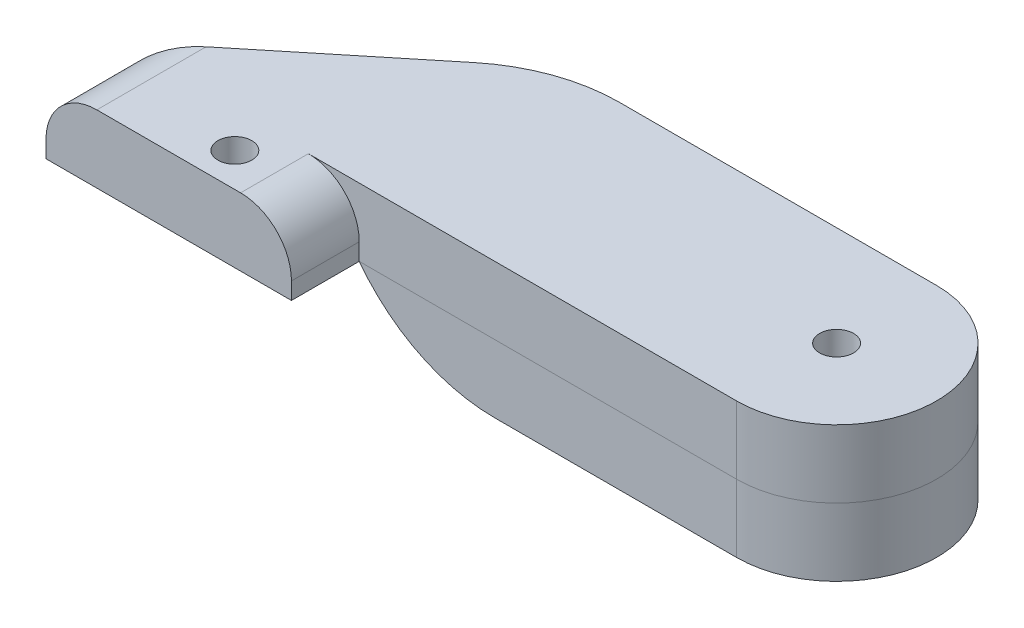
ISO-10303-21;
HEADER;
FILE_DESCRIPTION(('STEP AP214'),'2;1');
FILE_NAME('part.step','',(''),(''),'','','');
FILE_SCHEMA(('AUTOMOTIVE_DESIGN { 1 0 10303 214 1 1 1 1 }'));
ENDSEC;
DATA;
#1=APPLICATION_CONTEXT('core data for automotive mechanical design processes');
#2=APPLICATION_PROTOCOL_DEFINITION('international standard','automotive_design',2000,#1);
#3=PRODUCT_CONTEXT('',#1,'mechanical');
#4=PRODUCT('Part','Part','',(#3));
#5=PRODUCT_RELATED_PRODUCT_CATEGORY('part','',(#4));
#6=PRODUCT_DEFINITION_FORMATION('','',#4);
#7=PRODUCT_DEFINITION_CONTEXT('part definition',#1,'design');
#8=PRODUCT_DEFINITION('design','',#6,#7);
#9=PRODUCT_DEFINITION_SHAPE('','',#8);
#10=(LENGTH_UNIT() NAMED_UNIT(*) SI_UNIT(.MILLI.,.METRE.));
#11=(NAMED_UNIT(*) PLANE_ANGLE_UNIT() SI_UNIT($,.RADIAN.));
#12=(NAMED_UNIT(*) SI_UNIT($,.STERADIAN.) SOLID_ANGLE_UNIT());
#13=UNCERTAINTY_MEASURE_WITH_UNIT(LENGTH_MEASURE(1.E-05),#10,'distance_accuracy_value','');
#14=(GEOMETRIC_REPRESENTATION_CONTEXT(3) GLOBAL_UNCERTAINTY_ASSIGNED_CONTEXT((#13)) GLOBAL_UNIT_ASSIGNED_CONTEXT((#10,
#11,#12)) REPRESENTATION_CONTEXT('',''));
#15=CARTESIAN_POINT('',(0.,0.,0.));
#16=DIRECTION('',(0.,0.,1.));
#17=DIRECTION('',(1.,0.,0.));
#18=AXIS2_PLACEMENT_3D('',#15,#16,#17);
#19=CARTESIAN_POINT('',(19.8378099908885,4.,-1.99947612195635));
#20=DIRECTION('',(0.,0.,-1.));
#21=DIRECTION('',(-1.,0.,0.));
#22=AXIS2_PLACEMENT_3D('',#19,#20,#21);
#23=PLANE('',#22);
#24=DIRECTION('',(1.,0.,0.));
#25=VECTOR('',#24,1.);
#26=CARTESIAN_POINT('',(19.8378099908885,0.,-1.99947612195635));
#27=LINE('',#26,#25);
#28=CARTESIAN_POINT('',(19.8378099908885,0.,-1.99947612195635));
#29=VERTEX_POINT('',#28);
#30=CARTESIAN_POINT('',(42.1,0.,-1.99947612195635));
#31=VERTEX_POINT('',#30);
#32=EDGE_CURVE('E229',#29,#31,#27,.T.);
#33=ORIENTED_EDGE('',*,*,#32,.T.);
#34=DIRECTION('',(0.,-1.,0.));
#35=VECTOR('',#34,1.);
#36=CARTESIAN_POINT('',(42.1,4.,-1.99947612195635));
#37=LINE('',#36,#35);
#38=CARTESIAN_POINT('',(42.1,4.,-1.99947612195635));
#39=VERTEX_POINT('',#38);
#40=EDGE_CURVE('E272',#39,#31,#37,.T.);
#41=ORIENTED_EDGE('',*,*,#40,.F.);
#42=DIRECTION('',(1.,0.,0.));
#43=VECTOR('',#42,1.);
#44=CARTESIAN_POINT('',(19.8378099908885,4.,-1.99947612195635));
#45=LINE('',#44,#43);
#46=CARTESIAN_POINT('',(16.8378099908885,4.,-1.99947612195635));
#47=VERTEX_POINT('',#46);
#48=EDGE_CURVE('E230',#47,#39,#45,.T.);
#49=ORIENTED_EDGE('',*,*,#48,.F.);
#50=CARTESIAN_POINT('',(16.8378099908885,1.,-1.99947612195635));
#51=DIRECTION('',(0.,0.,-1.));
#52=DIRECTION('',(-1.,0.,0.));
#53=AXIS2_PLACEMENT_3D('',#50,#51,#52);
#54=CIRCLE('',#53,3.);
#55=CARTESIAN_POINT('',(19.8378099908885,1.,-1.99947612195635));
#56=VERTEX_POINT('',#55);
#57=EDGE_CURVE('E11',#47,#56,#54,.T.);
#58=ORIENTED_EDGE('',*,*,#57,.T.);
#59=DIRECTION('',(0.,-1.,0.));
#60=VECTOR('',#59,1.);
#61=CARTESIAN_POINT('',(19.8378099908885,4.,-1.99947612195635));
#62=LINE('',#61,#60);
#63=EDGE_CURVE('E245',#56,#29,#62,.T.);
#64=ORIENTED_EDGE('',*,*,#63,.T.);
#65=EDGE_LOOP('',(#33,#41,#49,#58,#64));
#66=FACE_BOUND('',#65,.T.);
#67=ADVANCED_FACE('F32',(#66),#23,.F.);
#68=CARTESIAN_POINT('',(42.1,4.,-7.89973806097817));
#69=DIRECTION('',(0.,-1.,0.));
#70=DIRECTION('',(0.,0.,-1.));
#71=AXIS2_PLACEMENT_3D('',#68,#69,#70);
#72=CYLINDRICAL_SURFACE('',#71,5.90026193902183);
#73=CARTESIAN_POINT('',(42.1,0.,-7.89973806097817));
#74=DIRECTION('',(0.,1.,0.));
#75=DIRECTION('',(0.,0.,-1.));
#76=AXIS2_PLACEMENT_3D('',#73,#74,#75);
#77=CIRCLE('',#76,5.90026193902183);
#78=CARTESIAN_POINT('',(42.1,0.,-13.8));
#79=VERTEX_POINT('',#78);
#80=EDGE_CURVE('E248',#31,#79,#77,.T.);
#81=ORIENTED_EDGE('',*,*,#80,.T.);
#82=DIRECTION('',(0.,-1.,0.));
#83=VECTOR('',#82,1.);
#84=CARTESIAN_POINT('',(42.1,4.,-13.8));
#85=LINE('',#84,#83);
#86=CARTESIAN_POINT('',(42.1,4.,-13.8));
#87=VERTEX_POINT('',#86);
#88=EDGE_CURVE('E269',#87,#79,#85,.T.);
#89=ORIENTED_EDGE('',*,*,#88,.F.);
#90=CARTESIAN_POINT('',(42.1,4.,-7.89973806097817));
#91=DIRECTION('',(0.,1.,0.));
#92=DIRECTION('',(0.,0.,-1.));
#93=AXIS2_PLACEMENT_3D('',#90,#91,#92);
#94=CIRCLE('',#93,5.90026193902183);
#95=EDGE_CURVE('E233',#39,#87,#94,.T.);
#96=ORIENTED_EDGE('',*,*,#95,.F.);
#97=ORIENTED_EDGE('',*,*,#40,.T.);
#98=EDGE_LOOP('',(#81,#89,#96,#97));
#99=FACE_BOUND('',#98,.T.);
#100=ADVANCED_FACE('F347',(#99),#72,.T.);
#101=CARTESIAN_POINT('',(19.8378099908885,4.,-13.8));
#102=DIRECTION('',(0.,0.,1.));
#103=DIRECTION('',(1.,0.,0.));
#104=AXIS2_PLACEMENT_3D('',#101,#102,#103);
#105=PLANE('',#104);
#106=CARTESIAN_POINT('',(27.8378099908885,6.,-13.8));
#107=DIRECTION('',(0.,0.,1.));
#108=DIRECTION('',(1.,0.,0.));
#109=AXIS2_PLACEMENT_3D('',#106,#107,#108);
#110=CIRCLE('',#109,10.);
#111=CARTESIAN_POINT('',(27.8378099908885,-4.,-13.8));
#112=VERTEX_POINT('',#111);
#113=CARTESIAN_POINT('',(23.3965286051537,-2.95963278559594,-13.8));
#114=VERTEX_POINT('',#113);
#115=EDGE_CURVE('E291',#112,#114,#110,.F.);
#116=ORIENTED_EDGE('',*,*,#115,.T.);
#117=DIRECTION('',(0.,-1.,0.));
#118=VECTOR('',#117,1.);
#119=CARTESIAN_POINT('',(23.3965286051537,4.,-13.8));
#120=LINE('',#119,#118);
#121=CARTESIAN_POINT('',(23.3965286051537,4.,-13.8));
#122=VERTEX_POINT('',#121);
#123=EDGE_CURVE('E384',#114,#122,#120,.F.);
#124=ORIENTED_EDGE('',*,*,#123,.T.);
#125=DIRECTION('',(-1.,0.,0.));
#126=VECTOR('',#125,1.);
#127=CARTESIAN_POINT('',(19.8378099908885,4.,-13.8));
#128=LINE('',#127,#126);
#129=EDGE_CURVE('E236',#87,#122,#128,.T.);
#130=ORIENTED_EDGE('',*,*,#129,.F.);
#131=ORIENTED_EDGE('',*,*,#88,.T.);
#132=DIRECTION('',(0.,1.,0.));
#133=VECTOR('',#132,1.);
#134=CARTESIAN_POINT('',(42.1,-4.,-13.8));
#135=LINE('',#134,#133);
#136=CARTESIAN_POINT('',(42.1,-4.,-13.8));
#137=VERTEX_POINT('',#136);
#138=EDGE_CURVE('E226',#137,#79,#135,.T.);
#139=ORIENTED_EDGE('',*,*,#138,.F.);
#140=DIRECTION('',(1.,0.,0.));
#141=VECTOR('',#140,1.);
#142=CARTESIAN_POINT('',(19.8378099908885,-4.,-13.8));
#143=LINE('',#142,#141);
#144=EDGE_CURVE('E208',#112,#137,#143,.T.);
#145=ORIENTED_EDGE('',*,*,#144,.F.);
#146=EDGE_LOOP('',(#116,#124,#130,#131,#139,#145));
#147=FACE_BOUND('',#146,.T.);
#148=ADVANCED_FACE('F343',(#147),#105,.F.);
#149=CARTESIAN_POINT('',(5.35780999088846,4.,-1.99947612195635));
#150=DIRECTION('',(0.631737468968907,0.,0.775182410985156));
#151=DIRECTION('',(0.775182410985156,0.,-0.631737468968907));
#152=AXIS2_PLACEMENT_3D('',#149,#150,#151);
#153=PLANE('',#152);
#154=DIRECTION('',(0.,-1.,0.));
#155=VECTOR('',#154,1.);
#156=CARTESIAN_POINT('',(5.35780999088846,4.,-1.99947612195635));
#157=LINE('',#156,#155);
#158=CARTESIAN_POINT('',(5.35780999088846,1.,-1.99947612195635));
#159=VERTEX_POINT('',#158);
#160=CARTESIAN_POINT('',(5.35780999088846,0.,-1.99947612195635));
#161=VERTEX_POINT('',#160);
#162=EDGE_CURVE('E267',#159,#161,#157,.T.);
#163=ORIENTED_EDGE('',*,*,#162,.F.);
#164=CARTESIAN_POINT('',(8.35780999088846,1.,-4.44433604144053));
#165=DIRECTION('',(0.631737468968907,0.,0.775182410985156));
#166=DIRECTION('',(-0.775182410985156,0.,0.631737468968907));
#167=AXIS2_PLACEMENT_3D('',#164,#165,#166);
#168=ELLIPSE('',#167,3.87005685047393,3.);
#169=CARTESIAN_POINT('',(8.35780999088846,4.,-4.44433604144053));
#170=VERTEX_POINT('',#169);
#171=EDGE_CURVE('E371',#159,#170,#168,.F.);
#172=ORIENTED_EDGE('',*,*,#171,.T.);
#173=DIRECTION('',(-0.775182410985156,0.,0.631737468968907));
#174=VECTOR('',#173,1.);
#175=CARTESIAN_POINT('',(5.35780999088846,4.,-1.99947612195635));
#176=LINE('',#175,#174);
#177=CARTESIAN_POINT('',(17.0791539154646,4.,-11.5518241098516));
#178=VERTEX_POINT('',#177);
#179=EDGE_CURVE('E239',#178,#170,#176,.T.);
#180=ORIENTED_EDGE('',*,*,#179,.F.);
#181=DIRECTION('',(0.,-1.,0.));
#182=VECTOR('',#181,1.);
#183=CARTESIAN_POINT('',(17.0791539154646,4.,-11.5518241098516));
#184=LINE('',#183,#182);
#185=CARTESIAN_POINT('',(17.0791539154646,0.,-11.5518241098516));
#186=VERTEX_POINT('',#185);
#187=EDGE_CURVE('E412',#178,#186,#184,.T.);
#188=ORIENTED_EDGE('',*,*,#187,.T.);
#189=DIRECTION('',(-0.775182410985156,0.,0.631737468968907));
#190=VECTOR('',#189,1.);
#191=CARTESIAN_POINT('',(5.35780999088846,0.,-1.99947612195635));
#192=LINE('',#191,#190);
#193=EDGE_CURVE('E251',#186,#161,#192,.T.);
#194=ORIENTED_EDGE('',*,*,#193,.T.);
#195=EDGE_LOOP('',(#163,#172,#180,#188,#194));
#196=FACE_BOUND('',#195,.T.);
#197=ADVANCED_FACE('F340',(#196),#153,.F.);
#198=CARTESIAN_POINT('',(5.35780999088846,4.,1.99947612195635));
#199=DIRECTION('',(1.,0.,0.));
#200=DIRECTION('',(0.,0.,-1.));
#201=AXIS2_PLACEMENT_3D('',#198,#199,#200);
#202=PLANE('',#201);
#203=DIRECTION('',(0.,-1.,0.));
#204=VECTOR('',#203,1.);
#205=CARTESIAN_POINT('',(5.35780999088846,4.,1.99947612195635));
#206=LINE('',#205,#204);
#207=CARTESIAN_POINT('',(5.35780999088846,1.,1.99947612195635));
#208=VERTEX_POINT('',#207);
#209=CARTESIAN_POINT('',(5.35780999088846,0.,1.99947612195635));
#210=VERTEX_POINT('',#209);
#211=EDGE_CURVE('E265',#208,#210,#206,.T.);
#212=ORIENTED_EDGE('',*,*,#211,.F.);
#213=DIRECTION('',(0.,0.,1.));
#214=VECTOR('',#213,1.);
#215=CARTESIAN_POINT('',(5.35780999088846,1.,1.99947612195635));
#216=LINE('',#215,#214);
#217=EDGE_CURVE('E53',#208,#159,#216,.F.);
#218=ORIENTED_EDGE('',*,*,#217,.T.);
#219=ORIENTED_EDGE('',*,*,#162,.T.);
#220=DIRECTION('',(0.,0.,1.));
#221=VECTOR('',#220,1.);
#222=CARTESIAN_POINT('',(5.35780999088846,0.,1.99947612195635));
#223=LINE('',#222,#221);
#224=EDGE_CURVE('E254',#161,#210,#223,.T.);
#225=ORIENTED_EDGE('',*,*,#224,.T.);
#226=EDGE_LOOP('',(#212,#218,#219,#225));
#227=FACE_BOUND('',#226,.T.);
#228=ADVANCED_FACE('F336',(#227),#202,.F.);
#229=CARTESIAN_POINT('',(5.35780999088846,4.,1.99947612195635));
#230=DIRECTION('',(0.,0.,-1.));
#231=DIRECTION('',(-1.,0.,0.));
#232=AXIS2_PLACEMENT_3D('',#229,#230,#231);
#233=PLANE('',#232);
#234=DIRECTION('',(1.,0.,0.));
#235=VECTOR('',#234,1.);
#236=CARTESIAN_POINT('',(5.35780999088846,4.,1.99947612195635));
#237=LINE('',#236,#235);
#238=CARTESIAN_POINT('',(8.35780999088846,4.,1.99947612195635));
#239=VERTEX_POINT('',#238);
#240=CARTESIAN_POINT('',(16.8378099908885,4.,1.99947612195635));
#241=VERTEX_POINT('',#240);
#242=EDGE_CURVE('E242',#239,#241,#237,.T.);
#243=ORIENTED_EDGE('',*,*,#242,.F.);
#244=CARTESIAN_POINT('',(8.35780999088846,1.,1.99947612195635));
#245=DIRECTION('',(0.,0.,-1.));
#246=DIRECTION('',(-1.,0.,0.));
#247=AXIS2_PLACEMENT_3D('',#244,#245,#246);
#248=CIRCLE('',#247,3.);
#249=EDGE_CURVE('E375',#239,#208,#248,.F.);
#250=ORIENTED_EDGE('',*,*,#249,.T.);
#251=ORIENTED_EDGE('',*,*,#211,.T.);
#252=DIRECTION('',(1.,0.,0.));
#253=VECTOR('',#252,1.);
#254=CARTESIAN_POINT('',(5.35780999088846,0.,1.99947612195635));
#255=LINE('',#254,#253);
#256=CARTESIAN_POINT('',(19.8378099908885,0.,1.99947612195635));
#257=VERTEX_POINT('',#256);
#258=EDGE_CURVE('E257',#210,#257,#255,.T.);
#259=ORIENTED_EDGE('',*,*,#258,.T.);
#260=DIRECTION('',(0.,-1.,0.));
#261=VECTOR('',#260,1.);
#262=CARTESIAN_POINT('',(19.8378099908885,4.,1.99947612195635));
#263=LINE('',#262,#261);
#264=CARTESIAN_POINT('',(19.8378099908885,1.,1.99947612195635));
#265=VERTEX_POINT('',#264);
#266=EDGE_CURVE('E263',#265,#257,#263,.T.);
#267=ORIENTED_EDGE('',*,*,#266,.F.);
#268=CARTESIAN_POINT('',(16.8378099908885,1.,1.99947612195635));
#269=DIRECTION('',(0.,0.,-1.));
#270=DIRECTION('',(-1.,0.,0.));
#271=AXIS2_PLACEMENT_3D('',#268,#269,#270);
#272=CIRCLE('',#271,3.);
#273=EDGE_CURVE('E369',#265,#241,#272,.F.);
#274=ORIENTED_EDGE('',*,*,#273,.T.);
#275=EDGE_LOOP('',(#243,#250,#251,#259,#267,#274));
#276=FACE_BOUND('',#275,.T.);
#277=ADVANCED_FACE('F332',(#276),#233,.F.);
#278=CARTESIAN_POINT('',(19.8378099908885,4.,1.99947612195635));
#279=DIRECTION('',(-1.,0.,0.));
#280=DIRECTION('',(0.,0.,1.));
#281=AXIS2_PLACEMENT_3D('',#278,#279,#280);
#282=PLANE('',#281);
#283=ORIENTED_EDGE('',*,*,#63,.F.);
#284=DIRECTION('',(0.,0.,-1.));
#285=VECTOR('',#284,1.);
#286=CARTESIAN_POINT('',(19.8378099908885,1.,1.99947612195635));
#287=LINE('',#286,#285);
#288=EDGE_CURVE('E40',#56,#265,#287,.F.);
#289=ORIENTED_EDGE('',*,*,#288,.T.);
#290=ORIENTED_EDGE('',*,*,#266,.T.);
#291=DIRECTION('',(0.,0.,-1.));
#292=VECTOR('',#291,1.);
#293=CARTESIAN_POINT('',(19.8378099908885,0.,1.99947612195635));
#294=LINE('',#293,#292);
#295=EDGE_CURVE('E234',#257,#29,#294,.T.);
#296=ORIENTED_EDGE('',*,*,#295,.T.);
#297=EDGE_LOOP('',(#283,#289,#290,#296));
#298=FACE_BOUND('',#297,.T.);
#299=ADVANCED_FACE('F325',(#298),#282,.F.);
#300=CARTESIAN_POINT('',(42.1,4.,-7.89973806097817));
#301=DIRECTION('',(0.,-1.,0.));
#302=DIRECTION('',(0.,0.,-1.));
#303=AXIS2_PLACEMENT_3D('',#300,#301,#302);
#304=PLANE('',#303);
#305=CARTESIAN_POINT('',(14.5,4.,0.));
#306=DIRECTION('',(0.,1.,0.));
#307=DIRECTION('',(0.,0.,1.));
#308=AXIS2_PLACEMENT_3D('',#305,#306,#307);
#309=CIRCLE('',#308,1.);
#310=CARTESIAN_POINT('',(14.5,4.,1.));
#311=VERTEX_POINT('',#310);
#312=EDGE_CURVE('E279',#311,#311,#309,.T.);
#313=ORIENTED_EDGE('',*,*,#312,.F.);
#314=EDGE_LOOP('',(#313));
#315=FACE_BOUND('',#314,.T.);
#316=CARTESIAN_POINT('',(42.1,4.,-7.9));
#317=DIRECTION('',(0.,-1.,0.));
#318=DIRECTION('',(0.,0.,-1.));
#319=AXIS2_PLACEMENT_3D('',#316,#317,#318);
#320=CIRCLE('',#319,0.999999999999998);
#321=CARTESIAN_POINT('',(42.1,4.,-8.9));
#322=VERTEX_POINT('',#321);
#323=EDGE_CURVE('E196',#322,#322,#320,.T.);
#324=ORIENTED_EDGE('',*,*,#323,.T.);
#325=EDGE_LOOP('',(#324));
#326=FACE_BOUND('',#325,.T.);
#327=ORIENTED_EDGE('',*,*,#179,.T.);
#328=DIRECTION('',(0.,0.,1.));
#329=VECTOR('',#328,1.);
#330=CARTESIAN_POINT('',(8.35780999088846,4.,-7.89973806097817));
#331=LINE('',#330,#329);
#332=EDGE_CURVE('E378',#170,#239,#331,.T.);
#333=ORIENTED_EDGE('',*,*,#332,.T.);
#334=ORIENTED_EDGE('',*,*,#242,.T.);
#335=DIRECTION('',(0.,0.,-1.));
#336=VECTOR('',#335,1.);
#337=CARTESIAN_POINT('',(16.8378099908885,4.,-7.89973806097817));
#338=LINE('',#337,#336);
#339=EDGE_CURVE('E365',#241,#47,#338,.T.);
#340=ORIENTED_EDGE('',*,*,#339,.T.);
#341=ORIENTED_EDGE('',*,*,#48,.T.);
#342=ORIENTED_EDGE('',*,*,#95,.T.);
#343=ORIENTED_EDGE('',*,*,#129,.T.);
#344=CARTESIAN_POINT('',(23.3965286051537,4.,-3.8));
#345=DIRECTION('',(0.,-1.,0.));
#346=DIRECTION('',(0.,0.,-1.));
#347=AXIS2_PLACEMENT_3D('',#344,#345,#346);
#348=CIRCLE('',#347,10.);
#349=EDGE_CURVE('E382',#122,#178,#348,.F.);
#350=ORIENTED_EDGE('',*,*,#349,.T.);
#351=EDGE_LOOP('',(#327,#333,#334,#340,#341,#342,#343,#350));
#352=FACE_BOUND('',#351,.T.);
#353=ADVANCED_FACE('F322',(#315,#326,#352),#304,.F.);
#354=CARTESIAN_POINT('',(42.1,0.,-7.89973806097817));
#355=DIRECTION('',(0.,-1.,0.));
#356=DIRECTION('',(0.,0.,-1.));
#357=AXIS2_PLACEMENT_3D('',#354,#355,#356);
#358=PLANE('',#357);
#359=CARTESIAN_POINT('',(14.5,0.,0.));
#360=DIRECTION('',(0.,-1.,0.));
#361=DIRECTION('',(0.,0.,-1.));
#362=AXIS2_PLACEMENT_3D('',#359,#360,#361);
#363=CIRCLE('',#362,1.);
#364=CARTESIAN_POINT('',(14.5,0.,-0.999999999999999));
#365=VERTEX_POINT('',#364);
#366=EDGE_CURVE('E276',#365,#365,#363,.T.);
#367=ORIENTED_EDGE('',*,*,#366,.F.);
#368=EDGE_LOOP('',(#367));
#369=FACE_BOUND('',#368,.T.);
#370=ORIENTED_EDGE('',*,*,#193,.F.);
#371=CARTESIAN_POINT('',(23.3965286051537,0.,-3.8));
#372=DIRECTION('',(0.,-1.,0.));
#373=DIRECTION('',(0.,0.,-1.));
#374=AXIS2_PLACEMENT_3D('',#371,#372,#373);
#375=CIRCLE('',#374,10.);
#376=CARTESIAN_POINT('',(19.8378099908885,0.,-13.1453476031918));
#377=VERTEX_POINT('',#376);
#378=EDGE_CURVE('E391',#186,#377,#375,.T.);
#379=ORIENTED_EDGE('',*,*,#378,.T.);
#380=DIRECTION('',(0.,0.,-1.));
#381=VECTOR('',#380,1.);
#382=CARTESIAN_POINT('',(19.8378099908885,0.,-2.));
#383=LINE('',#382,#381);
#384=CARTESIAN_POINT('',(19.8378099908885,0.,-2.));
#385=VERTEX_POINT('',#384);
#386=EDGE_CURVE('E203',#385,#377,#383,.T.);
#387=ORIENTED_EDGE('',*,*,#386,.F.);
#388=DIRECTION('',(-1.,0.,0.));
#389=VECTOR('',#388,1.);
#390=CARTESIAN_POINT('',(19.8378099908885,0.,-2.));
#391=LINE('',#390,#389);
#392=CARTESIAN_POINT('',(42.1,0.,-2.));
#393=VERTEX_POINT('',#392);
#394=EDGE_CURVE('E211',#393,#385,#391,.T.);
#395=ORIENTED_EDGE('',*,*,#394,.F.);
#396=CARTESIAN_POINT('',(42.1,0.,-7.9));
#397=DIRECTION('',(0.,-1.,0.));
#398=DIRECTION('',(0.,0.,1.));
#399=AXIS2_PLACEMENT_3D('',#396,#397,#398);
#400=CIRCLE('',#399,5.9);
#401=EDGE_CURVE('E219',#79,#393,#400,.T.);
#402=ORIENTED_EDGE('',*,*,#401,.F.);
#403=ORIENTED_EDGE('',*,*,#80,.F.);
#404=ORIENTED_EDGE('',*,*,#32,.F.);
#405=ORIENTED_EDGE('',*,*,#295,.F.);
#406=ORIENTED_EDGE('',*,*,#258,.F.);
#407=ORIENTED_EDGE('',*,*,#224,.F.);
#408=EDGE_LOOP('',(#370,#379,#387,#395,#402,#403,#404,#405,#406,#407));
#409=FACE_BOUND('',#408,.T.);
#410=ADVANCED_FACE('F320',(#369,#409),#358,.T.);
#411=CARTESIAN_POINT('',(42.1,-4.,-7.9));
#412=DIRECTION('',(0.,1.,0.));
#413=DIRECTION('',(0.,0.,1.));
#414=AXIS2_PLACEMENT_3D('',#411,#412,#413);
#415=CYLINDRICAL_SURFACE('',#414,5.9);
#416=ORIENTED_EDGE('',*,*,#401,.T.);
#417=DIRECTION('',(0.,1.,0.));
#418=VECTOR('',#417,1.);
#419=CARTESIAN_POINT('',(42.1,-4.,-2.));
#420=LINE('',#419,#418);
#421=CARTESIAN_POINT('',(42.1,-4.,-2.));
#422=VERTEX_POINT('',#421);
#423=EDGE_CURVE('E216',#422,#393,#420,.T.);
#424=ORIENTED_EDGE('',*,*,#423,.F.);
#425=CARTESIAN_POINT('',(42.1,-4.,-7.9));
#426=DIRECTION('',(0.,-1.,0.));
#427=DIRECTION('',(0.,0.,1.));
#428=AXIS2_PLACEMENT_3D('',#425,#426,#427);
#429=CIRCLE('',#428,5.9);
#430=EDGE_CURVE('E210',#137,#422,#429,.T.);
#431=ORIENTED_EDGE('',*,*,#430,.F.);
#432=ORIENTED_EDGE('',*,*,#138,.T.);
#433=EDGE_LOOP('',(#416,#424,#431,#432));
#434=FACE_BOUND('',#433,.T.);
#435=ADVANCED_FACE('F316',(#434),#415,.T.);
#436=CARTESIAN_POINT('',(19.8378099908885,-4.,-2.));
#437=DIRECTION('',(0.,0.,-1.));
#438=DIRECTION('',(-1.,0.,0.));
#439=AXIS2_PLACEMENT_3D('',#436,#437,#438);
#440=PLANE('',#439);
#441=ORIENTED_EDGE('',*,*,#394,.T.);
#442=CARTESIAN_POINT('',(27.8378099908885,6.,-2.));
#443=DIRECTION('',(0.,0.,-1.));
#444=DIRECTION('',(-1.,0.,0.));
#445=AXIS2_PLACEMENT_3D('',#442,#443,#444);
#446=CIRCLE('',#445,10.);
#447=CARTESIAN_POINT('',(27.8378099908885,-4.,-2.));
#448=VERTEX_POINT('',#447);
#449=EDGE_CURVE('E413',#385,#448,#446,.F.);
#450=ORIENTED_EDGE('',*,*,#449,.T.);
#451=DIRECTION('',(-1.,0.,0.));
#452=VECTOR('',#451,1.);
#453=CARTESIAN_POINT('',(19.8378099908885,-4.,-2.));
#454=LINE('',#453,#452);
#455=EDGE_CURVE('E213',#422,#448,#454,.T.);
#456=ORIENTED_EDGE('',*,*,#455,.F.);
#457=ORIENTED_EDGE('',*,*,#423,.T.);
#458=EDGE_LOOP('',(#441,#450,#456,#457));
#459=FACE_BOUND('',#458,.T.);
#460=ADVANCED_FACE('F312',(#459),#440,.F.);
#461=CARTESIAN_POINT('',(42.1,-4.,-7.9));
#462=DIRECTION('',(0.,1.,0.));
#463=DIRECTION('',(0.,0.,1.));
#464=AXIS2_PLACEMENT_3D('',#461,#462,#463);
#465=PLANE('',#464);
#466=ORIENTED_EDGE('',*,*,#455,.T.);
#467=DIRECTION('',(0.,0.,-1.));
#468=VECTOR('',#467,1.);
#469=CARTESIAN_POINT('',(27.8378099908885,-4.,-7.9));
#470=LINE('',#469,#468);
#471=CARTESIAN_POINT('',(27.8378099908885,-4.,-5.91224405454037));
#472=VERTEX_POINT('',#471);
#473=EDGE_CURVE('E281',#448,#472,#470,.T.);
#474=ORIENTED_EDGE('',*,*,#473,.T.);
#475=CARTESIAN_POINT('',(27.9847893225767,-4.,-7.9));
#476=DIRECTION('',(0.,-1.,0.));
#477=DIRECTION('',(0.,0.,-1.));
#478=AXIS2_PLACEMENT_3D('',#475,#476,#477);
#479=CIRCLE('',#478,1.99318253621028);
#480=CARTESIAN_POINT('',(27.9847893225767,-4.,-5.90681746378972));
#481=VERTEX_POINT('',#480);
#482=EDGE_CURVE('E186',#481,#472,#479,.T.);
#483=ORIENTED_EDGE('',*,*,#482,.F.);
#484=DIRECTION('',(-0.996592752773191,0.,-0.0824796042664717));
#485=VECTOR('',#484,1.);
#486=CARTESIAN_POINT('',(39.8683015015985,-4.,-4.9233190597585));
#487=LINE('',#486,#485);
#488=CARTESIAN_POINT('',(39.8683015015985,-4.,-4.9233190597585));
#489=VERTEX_POINT('',#488);
#490=EDGE_CURVE('E195',#489,#481,#487,.T.);
#491=ORIENTED_EDGE('',*,*,#490,.F.);
#492=CARTESIAN_POINT('',(42.1,-4.,-7.9));
#493=DIRECTION('',(0.,-1.,0.));
#494=DIRECTION('',(0.,0.,1.));
#495=AXIS2_PLACEMENT_3D('',#492,#493,#494);
#496=CIRCLE('',#495,3.72036390797519);
#497=CARTESIAN_POINT('',(39.8677816552149,-4.,-10.8762911263801));
#498=VERTEX_POINT('',#497);
#499=EDGE_CURVE('E166',#498,#489,#496,.T.);
#500=ORIENTED_EDGE('',*,*,#499,.F.);
#501=DIRECTION('',(0.996595143051305,0.,-0.082450717683648));
#502=VECTOR('',#501,1.);
#503=CARTESIAN_POINT('',(27.9847893225767,-4.,-9.89318253621028));
#504=LINE('',#503,#502);
#505=CARTESIAN_POINT('',(27.9847893225767,-4.,-9.89318253621028));
#506=VERTEX_POINT('',#505);
#507=EDGE_CURVE('E183',#506,#498,#504,.T.);
#508=ORIENTED_EDGE('',*,*,#507,.F.);
#509=CARTESIAN_POINT('',(27.8378099908885,-4.,-9.88775594545963));
#510=VERTEX_POINT('',#509);
#511=EDGE_CURVE('E198',#510,#506,#479,.T.);
#512=ORIENTED_EDGE('',*,*,#511,.F.);
#513=DIRECTION('',(0.,0.,-1.));
#514=VECTOR('',#513,1.);
#515=CARTESIAN_POINT('',(27.8378099908885,-4.,-7.9));
#516=LINE('',#515,#514);
#517=EDGE_CURVE('E275',#510,#112,#516,.T.);
#518=ORIENTED_EDGE('',*,*,#517,.T.);
#519=ORIENTED_EDGE('',*,*,#144,.T.);
#520=ORIENTED_EDGE('',*,*,#430,.T.);
#521=EDGE_LOOP('',(#466,#474,#483,#491,#500,#508,#512,#518,#519,#520));
#522=FACE_BOUND('',#521,.T.);
#523=ADVANCED_FACE('F309',(#522),#465,.F.);
#524=CARTESIAN_POINT('',(42.1,0.,-7.9));
#525=DIRECTION('',(0.,-1.,0.));
#526=DIRECTION('',(0.,0.,-1.));
#527=AXIS2_PLACEMENT_3D('',#524,#525,#526);
#528=CYLINDRICAL_SURFACE('',#527,3.72036390797519);
#529=ORIENTED_EDGE('',*,*,#499,.T.);
#530=DIRECTION('',(0.,-1.,0.));
#531=VECTOR('',#530,1.);
#532=CARTESIAN_POINT('',(39.8683015015985,0.,-4.9233190597585));
#533=LINE('',#532,#531);
#534=CARTESIAN_POINT('',(39.8683015015985,0.,-4.9233190597585));
#535=VERTEX_POINT('',#534);
#536=EDGE_CURVE('E159',#535,#489,#533,.T.);
#537=ORIENTED_EDGE('',*,*,#536,.F.);
#538=CARTESIAN_POINT('',(42.1,0.,-7.9));
#539=DIRECTION('',(0.,-1.,0.));
#540=DIRECTION('',(0.,0.,1.));
#541=AXIS2_PLACEMENT_3D('',#538,#539,#540);
#542=CIRCLE('',#541,3.72036390797519);
#543=CARTESIAN_POINT('',(39.8677816552149,0.,-10.8762911263801));
#544=VERTEX_POINT('',#543);
#545=EDGE_CURVE('E163',#544,#535,#542,.T.);
#546=ORIENTED_EDGE('',*,*,#545,.F.);
#547=DIRECTION('',(0.,-1.,0.));
#548=VECTOR('',#547,1.);
#549=CARTESIAN_POINT('',(39.8677816552149,0.,-10.8762911263801));
#550=LINE('',#549,#548);
#551=EDGE_CURVE('E201',#544,#498,#550,.T.);
#552=ORIENTED_EDGE('',*,*,#551,.T.);
#553=EDGE_LOOP('',(#529,#537,#546,#552));
#554=FACE_BOUND('',#553,.T.);
#555=ADVANCED_FACE('F161',(#554),#528,.F.);
#556=CARTESIAN_POINT('',(27.9847893225767,0.,-9.89318253621028));
#557=DIRECTION('',(-0.082450717683648,0.,-0.996595143051305));
#558=DIRECTION('',(-0.996595143051305,0.,0.082450717683648));
#559=AXIS2_PLACEMENT_3D('',#556,#557,#558);
#560=PLANE('',#559);
#561=ORIENTED_EDGE('',*,*,#507,.T.);
#562=ORIENTED_EDGE('',*,*,#551,.F.);
#563=DIRECTION('',(0.996595143051305,0.,-0.082450717683648));
#564=VECTOR('',#563,1.);
#565=CARTESIAN_POINT('',(27.9847893225767,0.,-9.89318253621028));
#566=LINE('',#565,#564);
#567=CARTESIAN_POINT('',(27.9847893225767,0.,-9.89318253621028));
#568=VERTEX_POINT('',#567);
#569=EDGE_CURVE('E171',#568,#544,#566,.T.);
#570=ORIENTED_EDGE('',*,*,#569,.F.);
#571=DIRECTION('',(0.,-1.,0.));
#572=VECTOR('',#571,1.);
#573=CARTESIAN_POINT('',(27.9847893225767,0.,-9.89318253621028));
#574=LINE('',#573,#572);
#575=EDGE_CURVE('E204',#568,#506,#574,.T.);
#576=ORIENTED_EDGE('',*,*,#575,.T.);
#577=EDGE_LOOP('',(#561,#562,#570,#576));
#578=FACE_BOUND('',#577,.T.);
#579=ADVANCED_FACE('F302',(#578),#560,.F.);
#580=CARTESIAN_POINT('',(27.9847893225767,0.,-7.9));
#581=DIRECTION('',(0.,-1.,0.));
#582=DIRECTION('',(0.,0.,-1.));
#583=AXIS2_PLACEMENT_3D('',#580,#581,#582);
#584=CYLINDRICAL_SURFACE('',#583,1.99318253621028);
#585=ORIENTED_EDGE('',*,*,#482,.T.);
#586=CARTESIAN_POINT('',(27.8378099908885,-4.,-5.91224405454037));
#587=CARTESIAN_POINT('',(27.7823928849669,-4.00000253423014,-5.91634147758684));
#588=CARTESIAN_POINT('',(27.7271745978801,-3.99953880095111,-5.92275630743162));
#589=CARTESIAN_POINT('',(27.6174865375112,-3.99772266766189,-5.94016551249825));
#590=CARTESIAN_POINT('',(27.5630166712771,-3.99637037904538,-5.95115931361435));
#591=CARTESIAN_POINT('',(27.4014854317449,-3.99105452305779,-5.99086716768523));
#592=CARTESIAN_POINT('',(27.2960419804691,-3.98583156153512,-6.02632724667027));
#593=CARTESIAN_POINT('',(27.0926916027147,-3.97272358168443,-6.11415975498804));
#594=CARTESIAN_POINT('',(26.9947855034019,-3.96483827169427,-6.16653403725627));
#595=CARTESIAN_POINT('',(26.8090914179651,-3.94738355271835,-6.28669998142304));
#596=CARTESIAN_POINT('',(26.7213042645025,-3.93781400530458,-6.35449291071895));
#597=CARTESIAN_POINT('',(26.5572561749886,-3.91801906229562,-6.50449889812398));
#598=CARTESIAN_POINT('',(26.481139826482,-3.90778737632073,-6.58686922660838));
#599=CARTESIAN_POINT('',(26.343727476832,-3.88800028595262,-6.76325382400196));
#600=CARTESIAN_POINT('',(26.2824334356659,-3.87844497111507,-6.85726963032839));
#601=CARTESIAN_POINT('',(26.1761177628335,-3.86112110013954,-7.05492923549886));
#602=CARTESIAN_POINT('',(26.1311879050972,-3.85336270728293,-7.15862335801005));
#603=CARTESIAN_POINT('',(26.0594435391529,-3.84066823924081,-7.37225704778101));
#604=CARTESIAN_POINT('',(26.0326263523124,-3.8357317467489,-7.48219568894813));
#605=CARTESIAN_POINT('',(25.9981842886753,-3.82934808577103,-7.7036256899331));
#606=CARTESIAN_POINT('',(25.9903067609431,-3.82785499417292,-7.81507643225986));
#607=CARTESIAN_POINT('',(25.993256407223,-3.82840905880976,-8.03771663543557));
#608=CARTESIAN_POINT('',(26.0040824507603,-3.83045600107922,-8.14890611166912));
#609=CARTESIAN_POINT('',(26.0438912871978,-3.83779717330859,-8.3667213170983));
#610=CARTESIAN_POINT('',(26.0726927326579,-3.84305895883083,-8.47338139834868));
#611=CARTESIAN_POINT('',(26.1474199558686,-3.85616613676807,-8.68035843308984));
#612=CARTESIAN_POINT('',(26.1933476120045,-3.86401181257049,-8.78067468938427));
#613=CARTESIAN_POINT('',(26.3015565463399,-3.88144454844544,-8.97323035649792));
#614=CARTESIAN_POINT('',(26.3639975519213,-3.89104831825821,-9.06537845478943));
#615=CARTESIAN_POINT('',(26.5032800673869,-3.91080041298129,-9.23798624811235));
#616=CARTESIAN_POINT('',(26.580121739547,-3.92094874402714,-9.3184458114117));
#617=CARTESIAN_POINT('',(26.7472884414676,-3.94072066241542,-9.46652562893528));
#618=CARTESIAN_POINT('',(26.8377828391799,-3.95033522165934,-9.53395611376073));
#619=CARTESIAN_POINT('',(27.0289581192655,-3.96769572413325,-9.65266169079494));
#620=CARTESIAN_POINT('',(27.1296375274395,-3.97544193724379,-9.70393911662327));
#621=CARTESIAN_POINT('',(27.3300340351911,-3.98756239708711,-9.78541988873883));
#622=CARTESIAN_POINT('',(27.4291836451408,-3.99215684311969,-9.81698109300289));
#623=CARTESIAN_POINT('',(27.5806995832612,-3.99682284370576,-9.8524835061283));
#624=CARTESIAN_POINT('',(27.6317070168889,-3.99800728065065,-9.86234717434679));
#625=CARTESIAN_POINT('',(27.7343558657957,-3.99959693597021,-9.87806844011512));
#626=CARTESIAN_POINT('',(27.78599738167,-4.00000202905403,-9.88392539342986));
#627=CARTESIAN_POINT('',(27.8378099908885,-4.,-9.88775594545963));
#628=B_SPLINE_CURVE_WITH_KNOTS('',3,(#586,#587,#588,#589,#590,#591,#592,#593,#594,#595,#596,
#597,#598,#599,#600,#601,#602,#603,#604,#605,#606,#607,#608,#609,#610,#611,#612,#613,#614,#615,
#616,#617,#618,#619,#620,#621,#622,#623,#624,#625,#626,#627),.UNSPECIFIED.,.F.,.F.,(4,2,2,2,2,2,
2,2,2,2,2,2,2,2,2,2,2,2,2,2,4),(0.,0.166600602244104,0.333180322596127,0.665566373725605,
0.997988849802042,1.33043866055568,1.66672210228773,2.00304998703092,2.34123604025392,
2.67937206912533,3.01297178027665,3.34655132881481,3.67681873351826,4.0071223722737,
4.3407458256428,4.67437303872108,5.01254364196529,5.35066536754238,5.66173454015207,
5.81748841874891,5.97326733495114),.UNSPECIFIED.);
#629=EDGE_CURVE('E284',#472,#510,#628,.T.);
#630=ORIENTED_EDGE('',*,*,#629,.T.);
#631=ORIENTED_EDGE('',*,*,#511,.T.);
#632=ORIENTED_EDGE('',*,*,#575,.F.);
#633=CARTESIAN_POINT('',(27.9847893225767,0.,-7.9));
#634=DIRECTION('',(0.,-1.,0.));
#635=DIRECTION('',(0.,0.,-1.));
#636=AXIS2_PLACEMENT_3D('',#633,#634,#635);
#637=CIRCLE('',#636,1.99318253621028);
#638=CARTESIAN_POINT('',(27.9847893225767,0.,-5.90681746378972));
#639=VERTEX_POINT('',#638);
#640=EDGE_CURVE('E179',#639,#568,#637,.T.);
#641=ORIENTED_EDGE('',*,*,#640,.F.);
#642=DIRECTION('',(0.,-1.,0.));
#643=VECTOR('',#642,1.);
#644=CARTESIAN_POINT('',(27.9847893225767,0.,-5.90681746378972));
#645=LINE('',#644,#643);
#646=EDGE_CURVE('E170',#639,#481,#645,.T.);
#647=ORIENTED_EDGE('',*,*,#646,.T.);
#648=EDGE_LOOP('',(#585,#630,#631,#632,#641,#647));
#649=FACE_BOUND('',#648,.T.);
#650=ADVANCED_FACE('F297',(#649),#584,.F.);
#651=CARTESIAN_POINT('',(39.8683015015985,0.,-4.9233190597585));
#652=DIRECTION('',(-0.0824796042664717,0.,0.996592752773191));
#653=DIRECTION('',(0.996592752773191,0.,0.0824796042664717));
#654=AXIS2_PLACEMENT_3D('',#651,#652,#653);
#655=PLANE('',#654);
#656=ORIENTED_EDGE('',*,*,#490,.T.);
#657=ORIENTED_EDGE('',*,*,#646,.F.);
#658=DIRECTION('',(-0.996592752773191,0.,-0.0824796042664717));
#659=VECTOR('',#658,1.);
#660=CARTESIAN_POINT('',(39.8683015015985,0.,-4.9233190597585));
#661=LINE('',#660,#659);
#662=EDGE_CURVE('E174',#535,#639,#661,.T.);
#663=ORIENTED_EDGE('',*,*,#662,.F.);
#664=ORIENTED_EDGE('',*,*,#536,.T.);
#665=EDGE_LOOP('',(#656,#657,#663,#664));
#666=FACE_BOUND('',#665,.T.);
#667=ADVANCED_FACE('F175',(#666),#655,.F.);
#668=CARTESIAN_POINT('',(42.1,0.,-7.9));
#669=DIRECTION('',(0.,1.,0.));
#670=DIRECTION('',(0.,0.,1.));
#671=AXIS2_PLACEMENT_3D('',#668,#669,#670);
#672=PLANE('',#671);
#673=CARTESIAN_POINT('',(42.1,0.,-7.9));
#674=DIRECTION('',(0.,-1.,0.));
#675=DIRECTION('',(0.,0.,-1.));
#676=AXIS2_PLACEMENT_3D('',#673,#674,#675);
#677=CIRCLE('',#676,0.999999999999998);
#678=CARTESIAN_POINT('',(42.1,0.,-8.9));
#679=VERTEX_POINT('',#678);
#680=EDGE_CURVE('E189',#679,#679,#677,.T.);
#681=ORIENTED_EDGE('',*,*,#680,.F.);
#682=EDGE_LOOP('',(#681));
#683=FACE_BOUND('',#682,.T.);
#684=ORIENTED_EDGE('',*,*,#545,.T.);
#685=ORIENTED_EDGE('',*,*,#662,.T.);
#686=ORIENTED_EDGE('',*,*,#640,.T.);
#687=ORIENTED_EDGE('',*,*,#569,.T.);
#688=EDGE_LOOP('',(#684,#685,#686,#687));
#689=FACE_BOUND('',#688,.T.);
#690=ADVANCED_FACE('F181',(#683,#689),#672,.F.);
#691=CARTESIAN_POINT('',(42.1,4.,-7.9));
#692=DIRECTION('',(0.,-1.,0.));
#693=DIRECTION('',(0.,0.,-1.));
#694=AXIS2_PLACEMENT_3D('',#691,#692,#693);
#695=CYLINDRICAL_SURFACE('',#694,0.999999999999998);
#696=ORIENTED_EDGE('',*,*,#323,.F.);
#697=EDGE_LOOP('',(#696));
#698=FACE_BOUND('',#697,.T.);
#699=ORIENTED_EDGE('',*,*,#680,.T.);
#700=EDGE_LOOP('',(#699));
#701=FACE_BOUND('',#700,.T.);
#702=ADVANCED_FACE('F450',(#698,#701),#695,.F.);
#703=CARTESIAN_POINT('',(14.5,-4.,0.));
#704=DIRECTION('',(0.,1.,0.));
#705=DIRECTION('',(0.,0.,1.));
#706=AXIS2_PLACEMENT_3D('',#703,#704,#705);
#707=CYLINDRICAL_SURFACE('',#706,1.);
#708=ORIENTED_EDGE('',*,*,#366,.T.);
#709=EDGE_LOOP('',(#708));
#710=FACE_BOUND('',#709,.T.);
#711=ORIENTED_EDGE('',*,*,#312,.T.);
#712=EDGE_LOOP('',(#711));
#713=FACE_BOUND('',#712,.T.);
#714=ADVANCED_FACE('F457',(#710,#713),#707,.F.);
#715=CARTESIAN_POINT('',(27.8378099908885,6.,-2.));
#716=DIRECTION('',(0.,0.,-1.));
#717=DIRECTION('',(-1.,0.,0.));
#718=AXIS2_PLACEMENT_3D('',#715,#716,#717);
#719=CYLINDRICAL_SURFACE('',#718,10.);
#720=ORIENTED_EDGE('',*,*,#386,.T.);
#721=CARTESIAN_POINT('',(19.8378099908885,0.,-13.1453476031918));
#722=CARTESIAN_POINT('',(19.99000008176,-0.202919848508002,-13.2033078814317));
#723=CARTESIAN_POINT('',(20.1501191278105,-0.400326150885494,-13.2600181448861));
#724=CARTESIAN_POINT('',(20.4858566617296,-0.78334187795966,-13.3686536004785));
#725=CARTESIAN_POINT('',(20.6614943842608,-0.968936158112036,-13.4205726865905));
#726=CARTESIAN_POINT('',(21.0234808940547,-1.32308587424148,-13.5161156700893));
#727=CARTESIAN_POINT('',(21.2095072116974,-1.49192720911801,-13.559897524209));
#728=CARTESIAN_POINT('',(21.5947593173042,-1.81585709525377,-13.6383051717906));
#729=CARTESIAN_POINT('',(21.7939753997095,-1.97095556680373,-13.6729376061445));
#730=CARTESIAN_POINT('',(22.2180521629612,-2.27591709221016,-13.7327698562939));
#731=CARTESIAN_POINT('',(22.4437381154534,-2.42479265986502,-13.7572146829426));
#732=CARTESIAN_POINT('',(22.7927014177275,-2.63514045861774,-13.7824461572498));
#733=CARTESIAN_POINT('',(22.9115000410055,-2.70346236587982,-13.7889545558528));
#734=CARTESIAN_POINT('',(23.151946678213,-2.83524126845481,-13.7977327267918));
#735=CARTESIAN_POINT('',(23.27359523825,-2.89869732124757,-13.8000016799226));
#736=CARTESIAN_POINT('',(23.3965286051537,-2.95963278559594,-13.8));
#737=B_SPLINE_CURVE_WITH_KNOTS('',3,(#721,#722,#723,#724,#725,#726,#727,#728,#729,#730,#731,
#732,#733,#734,#735,#736),.UNSPECIFIED.,.F.,.F.,(4,2,2,2,2,2,2,4),(0.,0.780474308784563,
1.56192992502478,2.32611656207673,3.08974699869989,3.90276918952022,4.31420509186072,
4.7257204894185),.UNSPECIFIED.);
#738=EDGE_CURVE('E386',#377,#114,#737,.T.);
#739=ORIENTED_EDGE('',*,*,#738,.T.);
#740=ORIENTED_EDGE('',*,*,#115,.F.);
#741=ORIENTED_EDGE('',*,*,#517,.F.);
#742=ORIENTED_EDGE('',*,*,#629,.F.);
#743=ORIENTED_EDGE('',*,*,#473,.F.);
#744=ORIENTED_EDGE('',*,*,#449,.F.);
#745=EDGE_LOOP('',(#720,#739,#740,#741,#742,#743,#744));
#746=FACE_BOUND('',#745,.T.);
#747=ADVANCED_FACE('F293',(#746),#719,.T.);
#748=CARTESIAN_POINT('',(23.3965286051537,4.,-3.8));
#749=DIRECTION('',(0.,-1.,0.));
#750=DIRECTION('',(0.,0.,-1.));
#751=AXIS2_PLACEMENT_3D('',#748,#749,#750);
#752=CYLINDRICAL_SURFACE('',#751,10.);
#753=ORIENTED_EDGE('',*,*,#349,.F.);
#754=ORIENTED_EDGE('',*,*,#123,.F.);
#755=ORIENTED_EDGE('',*,*,#738,.F.);
#756=ORIENTED_EDGE('',*,*,#378,.F.);
#757=ORIENTED_EDGE('',*,*,#187,.F.);
#758=EDGE_LOOP('',(#753,#754,#755,#756,#757));
#759=FACE_BOUND('',#758,.T.);
#760=ADVANCED_FACE('F393',(#759),#752,.T.);
#761=CARTESIAN_POINT('',(8.35780999088846,1.,-7.89973806097817));
#762=DIRECTION('',(0.,0.,1.));
#763=DIRECTION('',(1.,0.,0.));
#764=AXIS2_PLACEMENT_3D('',#761,#762,#763);
#765=CYLINDRICAL_SURFACE('',#764,3.);
#766=ORIENTED_EDGE('',*,*,#171,.F.);
#767=ORIENTED_EDGE('',*,*,#217,.F.);
#768=ORIENTED_EDGE('',*,*,#249,.F.);
#769=ORIENTED_EDGE('',*,*,#332,.F.);
#770=EDGE_LOOP('',(#766,#767,#768,#769));
#771=FACE_BOUND('',#770,.T.);
#772=ADVANCED_FACE('F396',(#771),#765,.T.);
#773=CARTESIAN_POINT('',(16.8378099908885,1.,-7.89973806097817));
#774=DIRECTION('',(0.,0.,-1.));
#775=DIRECTION('',(-1.,0.,0.));
#776=AXIS2_PLACEMENT_3D('',#773,#774,#775);
#777=CYLINDRICAL_SURFACE('',#776,3.);
#778=ORIENTED_EDGE('',*,*,#273,.F.);
#779=ORIENTED_EDGE('',*,*,#288,.F.);
#780=ORIENTED_EDGE('',*,*,#57,.F.);
#781=ORIENTED_EDGE('',*,*,#339,.F.);
#782=EDGE_LOOP('',(#778,#779,#780,#781));
#783=FACE_BOUND('',#782,.T.);
#784=ADVANCED_FACE('F34',(#783),#777,.T.);
#785=CLOSED_SHELL('',(#67,#100,#148,#197,#228,#277,#299,#353,#410,#435,#460,#523,#555,#579,#650,
#667,#690,#702,#714,#747,#760,#772,#784));
#786=MANIFOLD_SOLID_BREP('B2',#785);
#787=ADVANCED_BREP_SHAPE_REPRESENTATION('',(#18,#786),#14);
#788=SHAPE_DEFINITION_REPRESENTATION(#9,#787);
ENDSEC;
END-ISO-10303-21;
